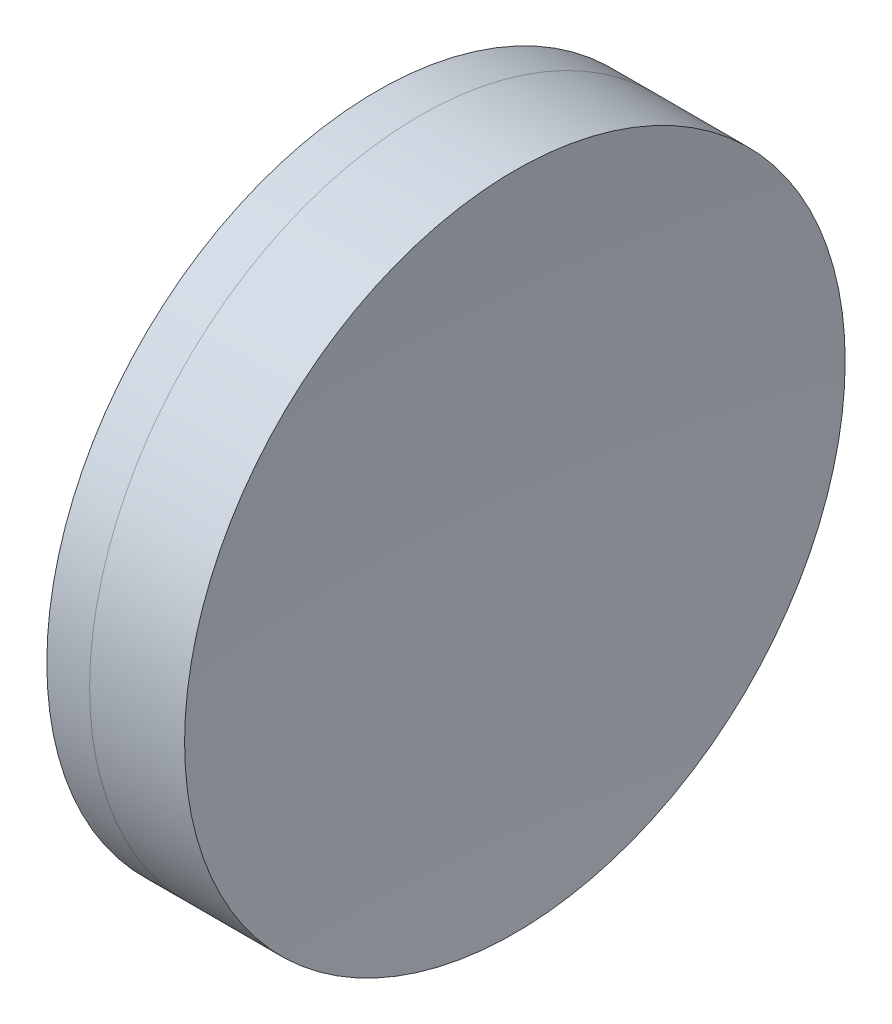
ISO-10303-21;
HEADER;
FILE_DESCRIPTION(('STEP AP214'),'2;1');
FILE_NAME('part.step','',(''),(''),'','','');
FILE_SCHEMA(('AUTOMOTIVE_DESIGN { 1 0 10303 214 1 1 1 1 }'));
ENDSEC;
DATA;
#1=APPLICATION_CONTEXT('core data for automotive mechanical design processes');
#2=APPLICATION_PROTOCOL_DEFINITION('international standard','automotive_design',2000,#1);
#3=PRODUCT_CONTEXT('',#1,'mechanical');
#4=PRODUCT('Part','Part','',(#3));
#5=PRODUCT_RELATED_PRODUCT_CATEGORY('part','',(#4));
#6=PRODUCT_DEFINITION_FORMATION('','',#4);
#7=PRODUCT_DEFINITION_CONTEXT('part definition',#1,'design');
#8=PRODUCT_DEFINITION('design','',#6,#7);
#9=PRODUCT_DEFINITION_SHAPE('','',#8);
#10=(LENGTH_UNIT() NAMED_UNIT(*) SI_UNIT(.MILLI.,.METRE.));
#11=(NAMED_UNIT(*) PLANE_ANGLE_UNIT() SI_UNIT($,.RADIAN.));
#12=(NAMED_UNIT(*) SI_UNIT($,.STERADIAN.) SOLID_ANGLE_UNIT());
#13=UNCERTAINTY_MEASURE_WITH_UNIT(LENGTH_MEASURE(1.E-05),#10,'distance_accuracy_value','');
#14=(GEOMETRIC_REPRESENTATION_CONTEXT(3) GLOBAL_UNCERTAINTY_ASSIGNED_CONTEXT((#13)) GLOBAL_UNIT_ASSIGNED_CONTEXT((#10,
#11,#12)) REPRESENTATION_CONTEXT('',''));
#15=CARTESIAN_POINT('',(0.,0.,0.));
#16=DIRECTION('',(0.,0.,1.));
#17=DIRECTION('',(1.,0.,0.));
#18=AXIS2_PLACEMENT_3D('',#15,#16,#17);
#19=CARTESIAN_POINT('',(262.940499792206,0.,-2.80875053678384E-13));
#20=DIRECTION('',(-1.,0.,0.));
#21=DIRECTION('',(0.,0.,1.));
#22=AXIS2_PLACEMENT_3D('',#19,#20,#21);
#23=SPHERICAL_SURFACE('',#22,77.4);
#24=CARTESIAN_POINT('',(339.291465732396,0.,0.));
#25=DIRECTION('',(-1.,0.,0.));
#26=DIRECTION('',(0.,0.,1.));
#27=AXIS2_PLACEMENT_3D('',#24,#25,#26);
#28=CIRCLE('',#27,12.6999999999999);
#29=CARTESIAN_POINT('',(339.291465732396,0.,12.6999999999999));
#30=VERTEX_POINT('',#29);
#31=EDGE_CURVE('E11',#30,#30,#28,.T.);
#32=ORIENTED_EDGE('',*,*,#31,.T.);
#33=EDGE_LOOP('',(#32));
#34=FACE_BOUND('',#33,.T.);
#35=ADVANCED_FACE('F45',(#34),#23,.F.);
#36=CARTESIAN_POINT('',(-0.551919992657797,0.,0.));
#37=DIRECTION('',(-1.,0.,0.));
#38=DIRECTION('',(0.,0.,1.));
#39=AXIS2_PLACEMENT_3D('',#36,#37,#38);
#40=CYLINDRICAL_SURFACE('',#39,12.7);
#41=CARTESIAN_POINT('',(342.943685737297,0.,0.));
#42=DIRECTION('',(-1.,0.,0.));
#43=DIRECTION('',(0.,0.,1.));
#44=AXIS2_PLACEMENT_3D('',#41,#42,#43);
#45=CIRCLE('',#44,12.7000000000001);
#46=CARTESIAN_POINT('',(342.943685737297,0.,12.7000000000001));
#47=VERTEX_POINT('',#46);
#48=EDGE_CURVE('E51',#47,#47,#45,.T.);
#49=ORIENTED_EDGE('',*,*,#48,.T.);
#50=EDGE_LOOP('',(#49));
#51=FACE_BOUND('',#50,.T.);
#52=ORIENTED_EDGE('',*,*,#31,.F.);
#53=EDGE_LOOP('',(#52));
#54=FACE_BOUND('',#53,.T.);
#55=ADVANCED_FACE('F57',(#51,#54),#40,.T.);
#56=CARTESIAN_POINT('',(476.340499792206,0.,0.));
#57=DIRECTION('',(-1.,0.,0.));
#58=DIRECTION('',(0.,0.,-1.));
#59=AXIS2_PLACEMENT_3D('',#56,#57,#58);
#60=SPHERICAL_SURFACE('',#59,134.);
#61=ORIENTED_EDGE('',*,*,#48,.F.);
#62=EDGE_LOOP('',(#61));
#63=FACE_BOUND('',#62,.T.);
#64=ADVANCED_FACE('F60',(#63),#60,.F.);
#65=CLOSED_SHELL('',(#35,#55,#64));
#66=MANIFOLD_SOLID_BREP('B2',#65);
#67=CARTESIAN_POINT('',(398.740499792206,0.,0.));
#68=DIRECTION('',(-1.,0.,0.));
#69=DIRECTION('',(0.,0.,-1.));
#70=AXIS2_PLACEMENT_3D('',#67,#68,#69);
#71=SPHERICAL_SURFACE('',#70,62.4);
#72=CARTESIAN_POINT('',(337.646555738806,0.,0.));
#73=DIRECTION('',(-1.,0.,0.));
#74=DIRECTION('',(0.,0.,1.));
#75=AXIS2_PLACEMENT_3D('',#72,#73,#74);
#76=CIRCLE('',#75,12.6999999999999);
#77=CARTESIAN_POINT('',(337.646555738806,0.,12.6999999999999));
#78=VERTEX_POINT('',#77);
#79=EDGE_CURVE('E44',#78,#78,#76,.T.);
#80=ORIENTED_EDGE('',*,*,#79,.T.);
#81=EDGE_LOOP('',(#80));
#82=FACE_BOUND('',#81,.T.);
#83=ADVANCED_FACE('F86',(#82),#71,.T.);
#84=CARTESIAN_POINT('',(124.523309526045,0.,0.));
#85=DIRECTION('',(-1.,0.,0.));
#86=DIRECTION('',(0.,0.,1.));
#87=AXIS2_PLACEMENT_3D('',#84,#85,#86);
#88=CYLINDRICAL_SURFACE('',#87,12.6999999999999);
#89=CARTESIAN_POINT('',(339.291465732396,0.,0.));
#90=DIRECTION('',(-1.,0.,0.));
#91=DIRECTION('',(0.,0.,1.));
#92=AXIS2_PLACEMENT_3D('',#89,#90,#91);
#93=CIRCLE('',#92,12.6999999999999);
#94=CARTESIAN_POINT('',(339.291465732396,0.,12.6999999999999));
#95=VERTEX_POINT('',#94);
#96=EDGE_CURVE('E92',#95,#95,#93,.T.);
#97=ORIENTED_EDGE('',*,*,#96,.T.);
#98=EDGE_LOOP('',(#97));
#99=FACE_BOUND('',#98,.T.);
#100=ORIENTED_EDGE('',*,*,#79,.F.);
#101=EDGE_LOOP('',(#100));
#102=FACE_BOUND('',#101,.T.);
#103=ADVANCED_FACE('F98',(#99,#102),#88,.T.);
#104=CARTESIAN_POINT('',(262.940499792206,0.,-2.80875053678384E-13));
#105=DIRECTION('',(-1.,0.,0.));
#106=DIRECTION('',(0.,0.,1.));
#107=AXIS2_PLACEMENT_3D('',#104,#105,#106);
#108=SPHERICAL_SURFACE('',#107,77.4);
#109=ORIENTED_EDGE('',*,*,#96,.F.);
#110=EDGE_LOOP('',(#109));
#111=FACE_BOUND('',#110,.T.);
#112=ADVANCED_FACE('F101',(#111),#108,.T.);
#113=CLOSED_SHELL('',(#83,#103,#112));
#114=MANIFOLD_SOLID_BREP('B6',#113);
#115=ADVANCED_BREP_SHAPE_REPRESENTATION('',(#18,#66,#114),#14);
#116=SHAPE_DEFINITION_REPRESENTATION(#9,#115);
ENDSEC;
END-ISO-10303-21;
